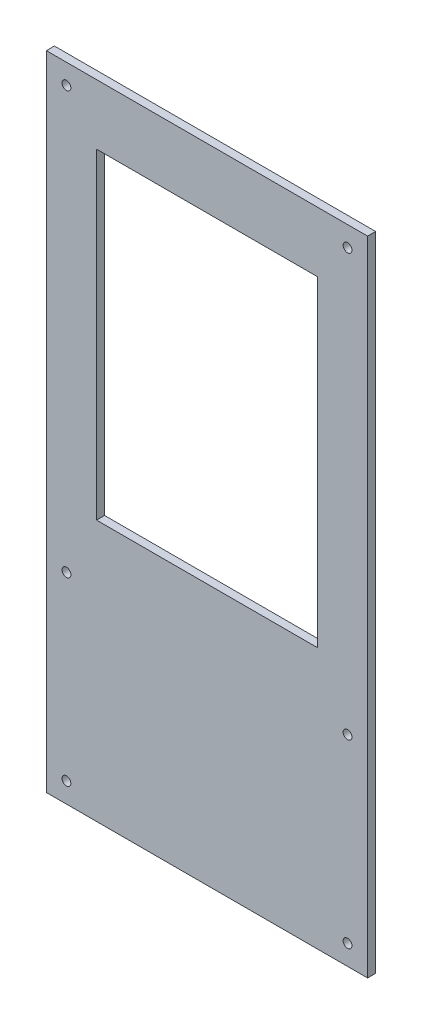
ISO-10303-21;
HEADER;
FILE_DESCRIPTION(('STEP AP214'),'2;1');
FILE_NAME('part.step','',(''),(''),'','','');
FILE_SCHEMA(('AUTOMOTIVE_DESIGN { 1 0 10303 214 1 1 1 1 }'));
ENDSEC;
DATA;
#1=APPLICATION_CONTEXT('core data for automotive mechanical design processes');
#2=APPLICATION_PROTOCOL_DEFINITION('international standard','automotive_design',2000,#1);
#3=PRODUCT_CONTEXT('',#1,'mechanical');
#4=PRODUCT('Part','Part','',(#3));
#5=PRODUCT_RELATED_PRODUCT_CATEGORY('part','',(#4));
#6=PRODUCT_DEFINITION_FORMATION('','',#4);
#7=PRODUCT_DEFINITION_CONTEXT('part definition',#1,'design');
#8=PRODUCT_DEFINITION('design','',#6,#7);
#9=PRODUCT_DEFINITION_SHAPE('','',#8);
#10=(LENGTH_UNIT() NAMED_UNIT(*) SI_UNIT(.MILLI.,.METRE.));
#11=(NAMED_UNIT(*) PLANE_ANGLE_UNIT() SI_UNIT($,.RADIAN.));
#12=(NAMED_UNIT(*) SI_UNIT($,.STERADIAN.) SOLID_ANGLE_UNIT());
#13=UNCERTAINTY_MEASURE_WITH_UNIT(LENGTH_MEASURE(1.E-05),#10,'distance_accuracy_value','');
#14=(GEOMETRIC_REPRESENTATION_CONTEXT(3) GLOBAL_UNCERTAINTY_ASSIGNED_CONTEXT((#13)) GLOBAL_UNIT_ASSIGNED_CONTEXT((#10,
#11,#12)) REPRESENTATION_CONTEXT('',''));
#15=CARTESIAN_POINT('',(0.,0.,0.));
#16=DIRECTION('',(0.,0.,1.));
#17=DIRECTION('',(1.,0.,0.));
#18=AXIS2_PLACEMENT_3D('',#15,#16,#17);
#19=CARTESIAN_POINT('',(0.,0.,4.));
#20=DIRECTION('',(0.,0.,-1.));
#21=DIRECTION('',(-1.,0.,0.));
#22=AXIS2_PLACEMENT_3D('',#19,#20,#21);
#23=PLANE('',#22);
#24=CARTESIAN_POINT('',(-70.,-90.,4.));
#25=DIRECTION('',(0.,0.,1.));
#26=DIRECTION('',(1.,0.,0.));
#27=AXIS2_PLACEMENT_3D('',#24,#25,#26);
#28=CIRCLE('',#27,2.2);
#29=CARTESIAN_POINT('',(-67.8,-90.,4.));
#30=VERTEX_POINT('',#29);
#31=EDGE_CURVE('E249',#30,#30,#28,.T.);
#32=ORIENTED_EDGE('',*,*,#31,.F.);
#33=EDGE_LOOP('',(#32));
#34=FACE_BOUND('',#33,.T.);
#35=CARTESIAN_POINT('',(70.,-90.,4.));
#36=DIRECTION('',(0.,0.,1.));
#37=DIRECTION('',(1.,0.,0.));
#38=AXIS2_PLACEMENT_3D('',#35,#36,#37);
#39=CIRCLE('',#38,2.2);
#40=CARTESIAN_POINT('',(72.2,-90.,4.));
#41=VERTEX_POINT('',#40);
#42=EDGE_CURVE('E175',#41,#41,#39,.T.);
#43=ORIENTED_EDGE('',*,*,#42,.F.);
#44=EDGE_LOOP('',(#43));
#45=FACE_BOUND('',#44,.T.);
#46=CARTESIAN_POINT('',(-70.,0.,4.));
#47=DIRECTION('',(0.,0.,1.));
#48=DIRECTION('',(-1.,0.,0.));
#49=AXIS2_PLACEMENT_3D('',#46,#47,#48);
#50=CIRCLE('',#49,2.2);
#51=CARTESIAN_POINT('',(-72.1999999999999,0.,4.));
#52=VERTEX_POINT('',#51);
#53=EDGE_CURVE('E270',#52,#52,#50,.T.);
#54=ORIENTED_EDGE('',*,*,#53,.F.);
#55=EDGE_LOOP('',(#54));
#56=FACE_BOUND('',#55,.T.);
#57=CARTESIAN_POINT('',(-70.,210.,4.));
#58=DIRECTION('',(0.,0.,1.));
#59=DIRECTION('',(-1.,0.,0.));
#60=AXIS2_PLACEMENT_3D('',#57,#58,#59);
#61=CIRCLE('',#60,2.2);
#62=CARTESIAN_POINT('',(-72.2,210.,4.));
#63=VERTEX_POINT('',#62);
#64=EDGE_CURVE('E203',#63,#63,#61,.T.);
#65=ORIENTED_EDGE('',*,*,#64,.F.);
#66=EDGE_LOOP('',(#65));
#67=FACE_BOUND('',#66,.T.);
#68=CARTESIAN_POINT('',(70.,210.,4.));
#69=DIRECTION('',(0.,0.,1.));
#70=DIRECTION('',(1.,0.,0.));
#71=AXIS2_PLACEMENT_3D('',#68,#69,#70);
#72=CIRCLE('',#71,2.2);
#73=CARTESIAN_POINT('',(72.2,210.,4.));
#74=VERTEX_POINT('',#73);
#75=EDGE_CURVE('E193',#74,#74,#72,.T.);
#76=ORIENTED_EDGE('',*,*,#75,.F.);
#77=EDGE_LOOP('',(#76));
#78=FACE_BOUND('',#77,.T.);
#79=CARTESIAN_POINT('',(70.,0.,4.));
#80=DIRECTION('',(0.,0.,1.));
#81=DIRECTION('',(1.,0.,0.));
#82=AXIS2_PLACEMENT_3D('',#79,#80,#81);
#83=CIRCLE('',#82,2.2);
#84=CARTESIAN_POINT('',(72.2,0.,4.));
#85=VERTEX_POINT('',#84);
#86=EDGE_CURVE('E130',#85,#85,#83,.T.);
#87=ORIENTED_EDGE('',*,*,#86,.F.);
#88=EDGE_LOOP('',(#87));
#89=FACE_BOUND('',#88,.T.);
#90=DIRECTION('',(0.,-1.,0.));
#91=VECTOR('',#90,1.);
#92=CARTESIAN_POINT('',(-80.,220.,4.));
#93=LINE('',#92,#91);
#94=CARTESIAN_POINT('',(-80.,220.,4.));
#95=VERTEX_POINT('',#94);
#96=CARTESIAN_POINT('',(-79.9999999999999,-100.,4.));
#97=VERTEX_POINT('',#96);
#98=EDGE_CURVE('E145',#95,#97,#93,.T.);
#99=ORIENTED_EDGE('',*,*,#98,.T.);
#100=DIRECTION('',(-1.,0.,0.));
#101=VECTOR('',#100,1.);
#102=CARTESIAN_POINT('',(-79.9999999999999,-100.,4.));
#103=LINE('',#102,#101);
#104=CARTESIAN_POINT('',(80.,-100.,4.));
#105=VERTEX_POINT('',#104);
#106=EDGE_CURVE('E108',#105,#97,#103,.T.);
#107=ORIENTED_EDGE('',*,*,#106,.F.);
#108=DIRECTION('',(0.,1.,0.));
#109=VECTOR('',#108,1.);
#110=CARTESIAN_POINT('',(80.,220.,4.));
#111=LINE('',#110,#109);
#112=CARTESIAN_POINT('',(80.,220.,4.));
#113=VERTEX_POINT('',#112);
#114=EDGE_CURVE('E148',#105,#113,#111,.T.);
#115=ORIENTED_EDGE('',*,*,#114,.T.);
#116=DIRECTION('',(-1.,0.,0.));
#117=VECTOR('',#116,1.);
#118=CARTESIAN_POINT('',(80.,220.,4.));
#119=LINE('',#118,#117);
#120=EDGE_CURVE('E140',#113,#95,#119,.T.);
#121=ORIENTED_EDGE('',*,*,#120,.T.);
#122=EDGE_LOOP('',(#99,#107,#115,#121));
#123=FACE_BOUND('',#122,.T.);
#124=DIRECTION('',(0.,1.,0.));
#125=VECTOR('',#124,1.);
#126=CARTESIAN_POINT('',(55.,190.,4.));
#127=LINE('',#126,#125);
#128=CARTESIAN_POINT('',(55.,30.,4.));
#129=VERTEX_POINT('',#128);
#130=CARTESIAN_POINT('',(55.,190.,4.));
#131=VERTEX_POINT('',#130);
#132=EDGE_CURVE('E168',#129,#131,#127,.T.);
#133=ORIENTED_EDGE('',*,*,#132,.F.);
#134=DIRECTION('',(1.,0.,0.));
#135=VECTOR('',#134,1.);
#136=CARTESIAN_POINT('',(-55.,30.,4.));
#137=LINE('',#136,#135);
#138=CARTESIAN_POINT('',(-55.,30.,4.));
#139=VERTEX_POINT('',#138);
#140=EDGE_CURVE('E300',#139,#129,#137,.T.);
#141=ORIENTED_EDGE('',*,*,#140,.F.);
#142=DIRECTION('',(0.,-1.,0.));
#143=VECTOR('',#142,1.);
#144=CARTESIAN_POINT('',(-55.,190.,4.));
#145=LINE('',#144,#143);
#146=CARTESIAN_POINT('',(-55.,190.,4.));
#147=VERTEX_POINT('',#146);
#148=EDGE_CURVE('E180',#147,#139,#145,.T.);
#149=ORIENTED_EDGE('',*,*,#148,.F.);
#150=DIRECTION('',(-1.,0.,0.));
#151=VECTOR('',#150,1.);
#152=CARTESIAN_POINT('',(-55.,190.,4.));
#153=LINE('',#152,#151);
#154=EDGE_CURVE('E173',#131,#147,#153,.T.);
#155=ORIENTED_EDGE('',*,*,#154,.F.);
#156=EDGE_LOOP('',(#133,#141,#149,#155));
#157=FACE_BOUND('',#156,.T.);
#158=ADVANCED_FACE('F41',(#34,#45,#56,#67,#78,#89,#123,#157),#23,.F.);
#159=CARTESIAN_POINT('',(0.,0.,0.));
#160=DIRECTION('',(0.,0.,-1.));
#161=DIRECTION('',(-1.,0.,0.));
#162=AXIS2_PLACEMENT_3D('',#159,#160,#161);
#163=PLANE('',#162);
#164=DIRECTION('',(-1.,0.,0.));
#165=VECTOR('',#164,1.);
#166=CARTESIAN_POINT('',(-79.9999999999999,-100.,0.));
#167=LINE('',#166,#165);
#168=CARTESIAN_POINT('',(80.,-100.,0.));
#169=VERTEX_POINT('',#168);
#170=CARTESIAN_POINT('',(-79.9999999999999,-100.,0.));
#171=VERTEX_POINT('',#170);
#172=EDGE_CURVE('E57',#169,#171,#167,.T.);
#173=ORIENTED_EDGE('',*,*,#172,.T.);
#174=DIRECTION('',(0.,-1.,0.));
#175=VECTOR('',#174,1.);
#176=CARTESIAN_POINT('',(-80.,220.,0.));
#177=LINE('',#176,#175);
#178=CARTESIAN_POINT('',(-80.,220.,0.));
#179=VERTEX_POINT('',#178);
#180=EDGE_CURVE('E123',#179,#171,#177,.T.);
#181=ORIENTED_EDGE('',*,*,#180,.F.);
#182=DIRECTION('',(-1.,0.,0.));
#183=VECTOR('',#182,1.);
#184=CARTESIAN_POINT('',(80.,220.,0.));
#185=LINE('',#184,#183);
#186=CARTESIAN_POINT('',(80.,220.,0.));
#187=VERTEX_POINT('',#186);
#188=EDGE_CURVE('E134',#187,#179,#185,.T.);
#189=ORIENTED_EDGE('',*,*,#188,.F.);
#190=DIRECTION('',(0.,1.,0.));
#191=VECTOR('',#190,1.);
#192=CARTESIAN_POINT('',(80.,220.,0.));
#193=LINE('',#192,#191);
#194=EDGE_CURVE('E124',#169,#187,#193,.T.);
#195=ORIENTED_EDGE('',*,*,#194,.F.);
#196=EDGE_LOOP('',(#173,#181,#189,#195));
#197=FACE_BOUND('',#196,.T.);
#198=CARTESIAN_POINT('',(-70.,-90.,0.));
#199=DIRECTION('',(0.,0.,1.));
#200=DIRECTION('',(1.,0.,0.));
#201=AXIS2_PLACEMENT_3D('',#198,#199,#200);
#202=CIRCLE('',#201,2.2);
#203=CARTESIAN_POINT('',(-67.8,-90.,0.));
#204=VERTEX_POINT('',#203);
#205=EDGE_CURVE('E245',#204,#204,#202,.T.);
#206=ORIENTED_EDGE('',*,*,#205,.T.);
#207=EDGE_LOOP('',(#206));
#208=FACE_BOUND('',#207,.T.);
#209=CARTESIAN_POINT('',(70.,-90.,0.));
#210=DIRECTION('',(0.,0.,1.));
#211=DIRECTION('',(1.,0.,0.));
#212=AXIS2_PLACEMENT_3D('',#209,#210,#211);
#213=CIRCLE('',#212,2.2);
#214=CARTESIAN_POINT('',(72.2,-90.,0.));
#215=VERTEX_POINT('',#214);
#216=EDGE_CURVE('E256',#215,#215,#213,.T.);
#217=ORIENTED_EDGE('',*,*,#216,.T.);
#218=EDGE_LOOP('',(#217));
#219=FACE_BOUND('',#218,.T.);
#220=CARTESIAN_POINT('',(-70.,0.,0.));
#221=DIRECTION('',(0.,0.,1.));
#222=DIRECTION('',(-1.,0.,0.));
#223=AXIS2_PLACEMENT_3D('',#220,#221,#222);
#224=CIRCLE('',#223,2.2);
#225=CARTESIAN_POINT('',(-72.1999999999999,0.,0.));
#226=VERTEX_POINT('',#225);
#227=EDGE_CURVE('E310',#226,#226,#224,.T.);
#228=ORIENTED_EDGE('',*,*,#227,.T.);
#229=EDGE_LOOP('',(#228));
#230=FACE_BOUND('',#229,.T.);
#231=CARTESIAN_POINT('',(70.,0.,0.));
#232=DIRECTION('',(0.,0.,1.));
#233=DIRECTION('',(1.,0.,0.));
#234=AXIS2_PLACEMENT_3D('',#231,#232,#233);
#235=CIRCLE('',#234,2.2);
#236=CARTESIAN_POINT('',(72.2,0.,0.));
#237=VERTEX_POINT('',#236);
#238=EDGE_CURVE('E137',#237,#237,#235,.T.);
#239=ORIENTED_EDGE('',*,*,#238,.T.);
#240=EDGE_LOOP('',(#239));
#241=FACE_BOUND('',#240,.T.);
#242=CARTESIAN_POINT('',(70.,210.,0.));
#243=DIRECTION('',(0.,0.,1.));
#244=DIRECTION('',(1.,0.,0.));
#245=AXIS2_PLACEMENT_3D('',#242,#243,#244);
#246=CIRCLE('',#245,2.2);
#247=CARTESIAN_POINT('',(72.2,210.,0.));
#248=VERTEX_POINT('',#247);
#249=EDGE_CURVE('E199',#248,#248,#246,.T.);
#250=ORIENTED_EDGE('',*,*,#249,.T.);
#251=EDGE_LOOP('',(#250));
#252=FACE_BOUND('',#251,.T.);
#253=CARTESIAN_POINT('',(-70.,210.,0.));
#254=DIRECTION('',(0.,0.,1.));
#255=DIRECTION('',(-1.,0.,0.));
#256=AXIS2_PLACEMENT_3D('',#253,#254,#255);
#257=CIRCLE('',#256,2.2);
#258=CARTESIAN_POINT('',(-72.2,210.,0.));
#259=VERTEX_POINT('',#258);
#260=EDGE_CURVE('E200',#259,#259,#257,.T.);
#261=ORIENTED_EDGE('',*,*,#260,.T.);
#262=EDGE_LOOP('',(#261));
#263=FACE_BOUND('',#262,.T.);
#264=DIRECTION('',(1.,0.,0.));
#265=VECTOR('',#264,1.);
#266=CARTESIAN_POINT('',(-55.,30.,0.));
#267=LINE('',#266,#265);
#268=CARTESIAN_POINT('',(-55.,30.,0.));
#269=VERTEX_POINT('',#268);
#270=CARTESIAN_POINT('',(55.,30.,0.));
#271=VERTEX_POINT('',#270);
#272=EDGE_CURVE('E174',#269,#271,#267,.T.);
#273=ORIENTED_EDGE('',*,*,#272,.T.);
#274=DIRECTION('',(0.,1.,0.));
#275=VECTOR('',#274,1.);
#276=CARTESIAN_POINT('',(55.,190.,0.));
#277=LINE('',#276,#275);
#278=CARTESIAN_POINT('',(55.,190.,0.));
#279=VERTEX_POINT('',#278);
#280=EDGE_CURVE('E114',#271,#279,#277,.T.);
#281=ORIENTED_EDGE('',*,*,#280,.T.);
#282=DIRECTION('',(-1.,0.,0.));
#283=VECTOR('',#282,1.);
#284=CARTESIAN_POINT('',(-55.,190.,0.));
#285=LINE('',#284,#283);
#286=CARTESIAN_POINT('',(-55.,190.,0.));
#287=VERTEX_POINT('',#286);
#288=EDGE_CURVE('E293',#279,#287,#285,.T.);
#289=ORIENTED_EDGE('',*,*,#288,.T.);
#290=DIRECTION('',(0.,-1.,0.));
#291=VECTOR('',#290,1.);
#292=CARTESIAN_POINT('',(-55.,190.,0.));
#293=LINE('',#292,#291);
#294=EDGE_CURVE('E288',#287,#269,#293,.T.);
#295=ORIENTED_EDGE('',*,*,#294,.T.);
#296=EDGE_LOOP('',(#273,#281,#289,#295));
#297=FACE_BOUND('',#296,.T.);
#298=ADVANCED_FACE('F120',(#197,#208,#219,#230,#241,#252,#263,#297),#163,.T.);
#299=CARTESIAN_POINT('',(-80.,220.,4.));
#300=DIRECTION('',(1.,0.,0.));
#301=DIRECTION('',(0.,1.,0.));
#302=AXIS2_PLACEMENT_3D('',#299,#300,#301);
#303=PLANE('',#302);
#304=ORIENTED_EDGE('',*,*,#180,.T.);
#305=DIRECTION('',(0.,0.,1.));
#306=VECTOR('',#305,1.);
#307=CARTESIAN_POINT('',(-79.9999999999999,-100.,0.));
#308=LINE('',#307,#306);
#309=EDGE_CURVE('E105',#171,#97,#308,.T.);
#310=ORIENTED_EDGE('',*,*,#309,.T.);
#311=ORIENTED_EDGE('',*,*,#98,.F.);
#312=DIRECTION('',(0.,0.,-1.));
#313=VECTOR('',#312,1.);
#314=CARTESIAN_POINT('',(-80.,220.,4.));
#315=LINE('',#314,#313);
#316=EDGE_CURVE('E50',#95,#179,#315,.T.);
#317=ORIENTED_EDGE('',*,*,#316,.T.);
#318=EDGE_LOOP('',(#304,#310,#311,#317));
#319=FACE_BOUND('',#318,.T.);
#320=ADVANCED_FACE('F43',(#319),#303,.F.);
#321=CARTESIAN_POINT('',(80.,220.,4.));
#322=DIRECTION('',(-1.,0.,0.));
#323=DIRECTION('',(0.,-1.,0.));
#324=AXIS2_PLACEMENT_3D('',#321,#322,#323);
#325=PLANE('',#324);
#326=ORIENTED_EDGE('',*,*,#114,.F.);
#327=DIRECTION('',(0.,0.,1.));
#328=VECTOR('',#327,1.);
#329=CARTESIAN_POINT('',(80.,-100.,0.));
#330=LINE('',#329,#328);
#331=EDGE_CURVE('E115',#169,#105,#330,.T.);
#332=ORIENTED_EDGE('',*,*,#331,.F.);
#333=ORIENTED_EDGE('',*,*,#194,.T.);
#334=DIRECTION('',(0.,0.,-1.));
#335=VECTOR('',#334,1.);
#336=CARTESIAN_POINT('',(80.,220.,4.));
#337=LINE('',#336,#335);
#338=EDGE_CURVE('E12',#113,#187,#337,.T.);
#339=ORIENTED_EDGE('',*,*,#338,.F.);
#340=EDGE_LOOP('',(#326,#332,#333,#339));
#341=FACE_BOUND('',#340,.T.);
#342=ADVANCED_FACE('F224',(#341),#325,.F.);
#343=CARTESIAN_POINT('',(80.,220.,4.));
#344=DIRECTION('',(0.,-1.,0.));
#345=DIRECTION('',(0.,0.,-1.));
#346=AXIS2_PLACEMENT_3D('',#343,#344,#345);
#347=PLANE('',#346);
#348=ORIENTED_EDGE('',*,*,#188,.T.);
#349=ORIENTED_EDGE('',*,*,#316,.F.);
#350=ORIENTED_EDGE('',*,*,#120,.F.);
#351=ORIENTED_EDGE('',*,*,#338,.T.);
#352=EDGE_LOOP('',(#348,#349,#350,#351));
#353=FACE_BOUND('',#352,.T.);
#354=ADVANCED_FACE('F214',(#353),#347,.F.);
#355=CARTESIAN_POINT('',(70.,0.,4.));
#356=DIRECTION('',(0.,0.,-1.));
#357=DIRECTION('',(-1.,0.,0.));
#358=AXIS2_PLACEMENT_3D('',#355,#356,#357);
#359=CYLINDRICAL_SURFACE('',#358,2.2);
#360=ORIENTED_EDGE('',*,*,#86,.T.);
#361=EDGE_LOOP('',(#360));
#362=FACE_BOUND('',#361,.T.);
#363=ORIENTED_EDGE('',*,*,#238,.F.);
#364=EDGE_LOOP('',(#363));
#365=FACE_BOUND('',#364,.T.);
#366=ADVANCED_FACE('F211',(#362,#365),#359,.F.);
#367=CARTESIAN_POINT('',(70.,210.,4.));
#368=DIRECTION('',(0.,0.,-1.));
#369=DIRECTION('',(-1.,0.,0.));
#370=AXIS2_PLACEMENT_3D('',#367,#368,#369);
#371=CYLINDRICAL_SURFACE('',#370,2.2);
#372=ORIENTED_EDGE('',*,*,#75,.T.);
#373=EDGE_LOOP('',(#372));
#374=FACE_BOUND('',#373,.T.);
#375=ORIENTED_EDGE('',*,*,#249,.F.);
#376=EDGE_LOOP('',(#375));
#377=FACE_BOUND('',#376,.T.);
#378=ADVANCED_FACE('F213',(#374,#377),#371,.F.);
#379=CARTESIAN_POINT('',(-70.,210.,4.));
#380=DIRECTION('',(0.,0.,-1.));
#381=DIRECTION('',(-1.,0.,0.));
#382=AXIS2_PLACEMENT_3D('',#379,#380,#381);
#383=CYLINDRICAL_SURFACE('',#382,2.2);
#384=ORIENTED_EDGE('',*,*,#64,.T.);
#385=EDGE_LOOP('',(#384));
#386=FACE_BOUND('',#385,.T.);
#387=ORIENTED_EDGE('',*,*,#260,.F.);
#388=EDGE_LOOP('',(#387));
#389=FACE_BOUND('',#388,.T.);
#390=ADVANCED_FACE('F221',(#386,#389),#383,.F.);
#391=CARTESIAN_POINT('',(-70.,0.,4.));
#392=DIRECTION('',(0.,0.,-1.));
#393=DIRECTION('',(-1.,0.,0.));
#394=AXIS2_PLACEMENT_3D('',#391,#392,#393);
#395=CYLINDRICAL_SURFACE('',#394,2.2);
#396=ORIENTED_EDGE('',*,*,#53,.T.);
#397=EDGE_LOOP('',(#396));
#398=FACE_BOUND('',#397,.T.);
#399=ORIENTED_EDGE('',*,*,#227,.F.);
#400=EDGE_LOOP('',(#399));
#401=FACE_BOUND('',#400,.T.);
#402=ADVANCED_FACE('F348',(#398,#401),#395,.F.);
#403=CARTESIAN_POINT('',(55.,190.,4.));
#404=DIRECTION('',(-1.,0.,0.));
#405=DIRECTION('',(0.,-1.,0.));
#406=AXIS2_PLACEMENT_3D('',#403,#404,#405);
#407=PLANE('',#406);
#408=ORIENTED_EDGE('',*,*,#280,.F.);
#409=DIRECTION('',(0.,0.,-1.));
#410=VECTOR('',#409,1.);
#411=CARTESIAN_POINT('',(55.,30.,4.));
#412=LINE('',#411,#410);
#413=EDGE_CURVE('E297',#129,#271,#412,.T.);
#414=ORIENTED_EDGE('',*,*,#413,.F.);
#415=ORIENTED_EDGE('',*,*,#132,.T.);
#416=DIRECTION('',(0.,0.,-1.));
#417=VECTOR('',#416,1.);
#418=CARTESIAN_POINT('',(55.,190.,4.));
#419=LINE('',#418,#417);
#420=EDGE_CURVE('E306',#131,#279,#419,.T.);
#421=ORIENTED_EDGE('',*,*,#420,.T.);
#422=EDGE_LOOP('',(#408,#414,#415,#421));
#423=FACE_BOUND('',#422,.T.);
#424=ADVANCED_FACE('F333',(#423),#407,.T.);
#425=CARTESIAN_POINT('',(-55.,190.,4.));
#426=DIRECTION('',(0.,-1.,0.));
#427=DIRECTION('',(0.,0.,-1.));
#428=AXIS2_PLACEMENT_3D('',#425,#426,#427);
#429=PLANE('',#428);
#430=ORIENTED_EDGE('',*,*,#288,.F.);
#431=ORIENTED_EDGE('',*,*,#420,.F.);
#432=ORIENTED_EDGE('',*,*,#154,.T.);
#433=DIRECTION('',(0.,0.,-1.));
#434=VECTOR('',#433,1.);
#435=CARTESIAN_POINT('',(-55.,190.,4.));
#436=LINE('',#435,#434);
#437=EDGE_CURVE('E303',#147,#287,#436,.T.);
#438=ORIENTED_EDGE('',*,*,#437,.T.);
#439=EDGE_LOOP('',(#430,#431,#432,#438));
#440=FACE_BOUND('',#439,.T.);
#441=ADVANCED_FACE('F340',(#440),#429,.T.);
#442=CARTESIAN_POINT('',(-55.,190.,4.));
#443=DIRECTION('',(1.,0.,0.));
#444=DIRECTION('',(0.,1.,0.));
#445=AXIS2_PLACEMENT_3D('',#442,#443,#444);
#446=PLANE('',#445);
#447=ORIENTED_EDGE('',*,*,#294,.F.);
#448=ORIENTED_EDGE('',*,*,#437,.F.);
#449=ORIENTED_EDGE('',*,*,#148,.T.);
#450=DIRECTION('',(0.,0.,-1.));
#451=VECTOR('',#450,1.);
#452=CARTESIAN_POINT('',(-55.,30.,4.));
#453=LINE('',#452,#451);
#454=EDGE_CURVE('E65',#139,#269,#453,.T.);
#455=ORIENTED_EDGE('',*,*,#454,.T.);
#456=EDGE_LOOP('',(#447,#448,#449,#455));
#457=FACE_BOUND('',#456,.T.);
#458=ADVANCED_FACE('F327',(#457),#446,.T.);
#459=CARTESIAN_POINT('',(-55.,30.,4.));
#460=DIRECTION('',(0.,1.,0.));
#461=DIRECTION('',(0.,0.,1.));
#462=AXIS2_PLACEMENT_3D('',#459,#460,#461);
#463=PLANE('',#462);
#464=ORIENTED_EDGE('',*,*,#272,.F.);
#465=ORIENTED_EDGE('',*,*,#454,.F.);
#466=ORIENTED_EDGE('',*,*,#140,.T.);
#467=ORIENTED_EDGE('',*,*,#413,.T.);
#468=EDGE_LOOP('',(#464,#465,#466,#467));
#469=FACE_BOUND('',#468,.T.);
#470=ADVANCED_FACE('F331',(#469),#463,.T.);
#471=CARTESIAN_POINT('',(-79.9999999999999,-100.,0.));
#472=DIRECTION('',(0.,1.,0.));
#473=DIRECTION('',(0.,0.,1.));
#474=AXIS2_PLACEMENT_3D('',#471,#472,#473);
#475=PLANE('',#474);
#476=ORIENTED_EDGE('',*,*,#106,.T.);
#477=ORIENTED_EDGE('',*,*,#309,.F.);
#478=ORIENTED_EDGE('',*,*,#172,.F.);
#479=ORIENTED_EDGE('',*,*,#331,.T.);
#480=EDGE_LOOP('',(#476,#477,#478,#479));
#481=FACE_BOUND('',#480,.T.);
#482=ADVANCED_FACE('F106',(#481),#475,.F.);
#483=CARTESIAN_POINT('',(70.,-90.,0.));
#484=DIRECTION('',(0.,0.,1.));
#485=DIRECTION('',(1.,0.,0.));
#486=AXIS2_PLACEMENT_3D('',#483,#484,#485);
#487=CYLINDRICAL_SURFACE('',#486,2.2);
#488=ORIENTED_EDGE('',*,*,#216,.F.);
#489=EDGE_LOOP('',(#488));
#490=FACE_BOUND('',#489,.T.);
#491=ORIENTED_EDGE('',*,*,#42,.T.);
#492=EDGE_LOOP('',(#491));
#493=FACE_BOUND('',#492,.T.);
#494=ADVANCED_FACE('F265',(#490,#493),#487,.F.);
#495=CARTESIAN_POINT('',(-70.,-90.,0.));
#496=DIRECTION('',(0.,0.,1.));
#497=DIRECTION('',(1.,0.,0.));
#498=AXIS2_PLACEMENT_3D('',#495,#496,#497);
#499=CYLINDRICAL_SURFACE('',#498,2.2);
#500=ORIENTED_EDGE('',*,*,#205,.F.);
#501=EDGE_LOOP('',(#500));
#502=FACE_BOUND('',#501,.T.);
#503=ORIENTED_EDGE('',*,*,#31,.T.);
#504=EDGE_LOOP('',(#503));
#505=FACE_BOUND('',#504,.T.);
#506=ADVANCED_FACE('F398',(#502,#505),#499,.F.);
#507=CLOSED_SHELL('',(#158,#298,#320,#342,#354,#366,#378,#390,#402,#424,#441,#458,#470,#482,
#494,#506));
#508=MANIFOLD_SOLID_BREP('B2',#507);
#509=ADVANCED_BREP_SHAPE_REPRESENTATION('',(#18,#508),#14);
#510=SHAPE_DEFINITION_REPRESENTATION(#9,#509);
ENDSEC;
END-ISO-10303-21;
